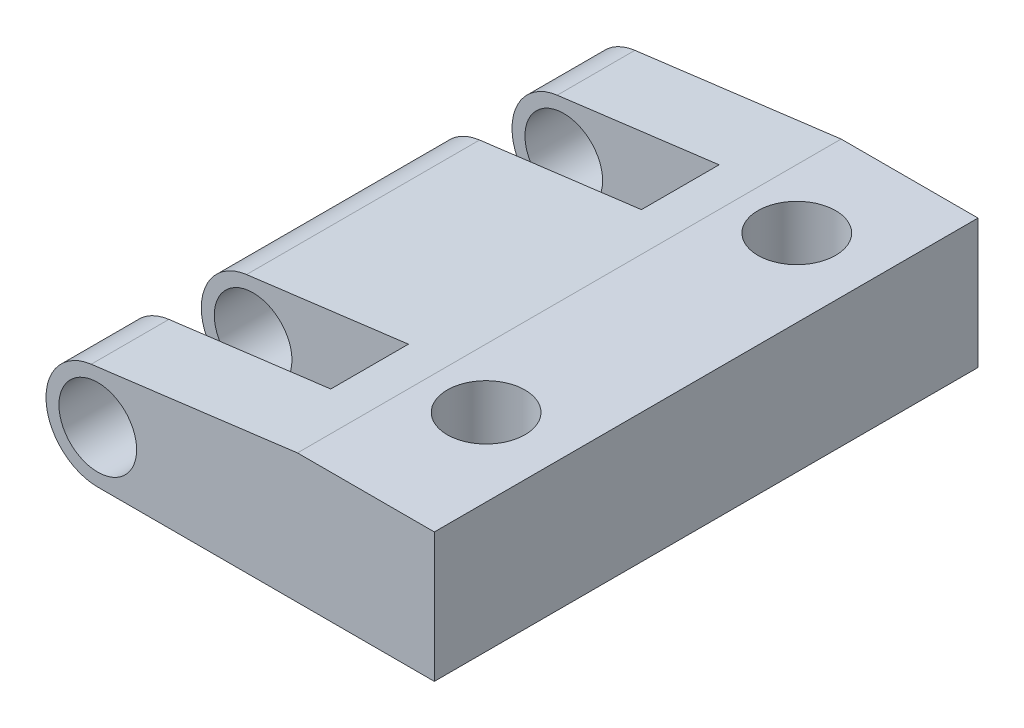
ISO-10303-21;
HEADER;
FILE_DESCRIPTION(('STEP AP214'),'2;1');
FILE_NAME('part.step','',(''),(''),'','','');
FILE_SCHEMA(('AUTOMOTIVE_DESIGN { 1 0 10303 214 1 1 1 1 }'));
ENDSEC;
DATA;
#1=APPLICATION_CONTEXT('core data for automotive mechanical design processes');
#2=APPLICATION_PROTOCOL_DEFINITION('international standard','automotive_design',2000,#1);
#3=PRODUCT_CONTEXT('',#1,'mechanical');
#4=PRODUCT('Part','Part','',(#3));
#5=PRODUCT_RELATED_PRODUCT_CATEGORY('part','',(#4));
#6=PRODUCT_DEFINITION_FORMATION('','',#4);
#7=PRODUCT_DEFINITION_CONTEXT('part definition',#1,'design');
#8=PRODUCT_DEFINITION('design','',#6,#7);
#9=PRODUCT_DEFINITION_SHAPE('','',#8);
#10=(LENGTH_UNIT() NAMED_UNIT(*) SI_UNIT(.MILLI.,.METRE.));
#11=(NAMED_UNIT(*) PLANE_ANGLE_UNIT() SI_UNIT($,.RADIAN.));
#12=(NAMED_UNIT(*) SI_UNIT($,.STERADIAN.) SOLID_ANGLE_UNIT());
#13=UNCERTAINTY_MEASURE_WITH_UNIT(LENGTH_MEASURE(1.E-05),#10,'distance_accuracy_value','');
#14=(GEOMETRIC_REPRESENTATION_CONTEXT(3) GLOBAL_UNCERTAINTY_ASSIGNED_CONTEXT((#13)) GLOBAL_UNIT_ASSIGNED_CONTEXT((#10,
#11,#12)) REPRESENTATION_CONTEXT('',''));
#15=CARTESIAN_POINT('',(0.,0.,0.));
#16=DIRECTION('',(0.,0.,1.));
#17=DIRECTION('',(1.,0.,0.));
#18=AXIS2_PLACEMENT_3D('',#15,#16,#17);
#19=CARTESIAN_POINT('',(-1.93619011185518,5.,21.));
#20=DIRECTION('',(0.126515745811455,-0.99196459919786,0.));
#21=DIRECTION('',(0.99196459919786,0.126515745811455,0.));
#22=AXIS2_PLACEMENT_3D('',#19,#20,#21);
#23=PLANE('',#22);
#24=DIRECTION('',(-0.99196459919786,-0.126515745811455,0.));
#25=VECTOR('',#24,1.);
#26=CARTESIAN_POINT('',(-1.93619011185518,5.,3.));
#27=LINE('',#26,#25);
#28=CARTESIAN_POINT('',(-3.64980545146626,4.78144449620464,3.));
#29=VERTEX_POINT('',#28);
#30=CARTESIAN_POINT('',(-9.90283694308917,3.98392919839572,3.));
#31=VERTEX_POINT('',#30);
#32=EDGE_CURVE('E189',#29,#31,#27,.T.);
#33=ORIENTED_EDGE('',*,*,#32,.F.);
#34=DIRECTION('',(0.,0.,-1.));
#35=VECTOR('',#34,1.);
#36=CARTESIAN_POINT('',(-3.64980545146626,4.78144449620464,21.));
#37=LINE('',#36,#35);
#38=CARTESIAN_POINT('',(-3.64980545146626,4.78144449620464,6.));
#39=VERTEX_POINT('',#38);
#40=EDGE_CURVE('E137',#39,#29,#37,.T.);
#41=ORIENTED_EDGE('',*,*,#40,.F.);
#42=DIRECTION('',(0.99196459919786,0.126515745811455,0.));
#43=VECTOR('',#42,1.);
#44=CARTESIAN_POINT('',(-1.93619011185518,5.,6.));
#45=LINE('',#44,#43);
#46=CARTESIAN_POINT('',(-9.90283694308917,3.98392919839572,6.));
#47=VERTEX_POINT('',#46);
#48=EDGE_CURVE('E186',#47,#39,#45,.T.);
#49=ORIENTED_EDGE('',*,*,#48,.F.);
#50=DIRECTION('',(0.,0.,-1.));
#51=VECTOR('',#50,1.);
#52=CARTESIAN_POINT('',(-9.90283694308917,3.98392919839572,21.));
#53=LINE('',#52,#51);
#54=CARTESIAN_POINT('',(-9.90283694308917,3.98392919839572,15.));
#55=VERTEX_POINT('',#54);
#56=EDGE_CURVE('E44',#55,#47,#53,.T.);
#57=ORIENTED_EDGE('',*,*,#56,.F.);
#58=DIRECTION('',(-0.99196459919786,-0.126515745811455,0.));
#59=VECTOR('',#58,1.);
#60=CARTESIAN_POINT('',(-1.93619011185518,5.,15.));
#61=LINE('',#60,#59);
#62=CARTESIAN_POINT('',(-3.64980545146626,4.78144449620464,15.));
#63=VERTEX_POINT('',#62);
#64=EDGE_CURVE('E181',#63,#55,#61,.T.);
#65=ORIENTED_EDGE('',*,*,#64,.F.);
#66=DIRECTION('',(0.,0.,-1.));
#67=VECTOR('',#66,1.);
#68=CARTESIAN_POINT('',(-3.64980545146626,4.78144449620464,21.));
#69=LINE('',#68,#67);
#70=CARTESIAN_POINT('',(-3.64980545146626,4.78144449620464,18.));
#71=VERTEX_POINT('',#70);
#72=EDGE_CURVE('E191',#71,#63,#69,.T.);
#73=ORIENTED_EDGE('',*,*,#72,.F.);
#74=DIRECTION('',(0.99196459919786,0.126515745811455,0.));
#75=VECTOR('',#74,1.);
#76=CARTESIAN_POINT('',(-1.93619011185518,5.,18.));
#77=LINE('',#76,#75);
#78=CARTESIAN_POINT('',(-9.90283694308917,3.98392919839572,18.));
#79=VERTEX_POINT('',#78);
#80=EDGE_CURVE('E176',#79,#71,#77,.T.);
#81=ORIENTED_EDGE('',*,*,#80,.F.);
#82=CARTESIAN_POINT('',(-9.90283694308917,3.98392919839572,21.));
#83=VERTEX_POINT('',#82);
#84=EDGE_CURVE('E11',#83,#79,#53,.T.);
#85=ORIENTED_EDGE('',*,*,#84,.F.);
#86=DIRECTION('',(-0.99196459919786,-0.126515745811455,0.));
#87=VECTOR('',#86,1.);
#88=CARTESIAN_POINT('',(-1.93619011185518,5.,21.));
#89=LINE('',#88,#87);
#90=CARTESIAN_POINT('',(-1.93619011185518,5.,21.));
#91=VERTEX_POINT('',#90);
#92=EDGE_CURVE('E201',#91,#83,#89,.T.);
#93=ORIENTED_EDGE('',*,*,#92,.F.);
#94=DIRECTION('',(0.,0.,-1.));
#95=VECTOR('',#94,1.);
#96=CARTESIAN_POINT('',(-1.93619011185518,5.,21.));
#97=LINE('',#96,#95);
#98=CARTESIAN_POINT('',(-1.93619011185518,5.,0.));
#99=VERTEX_POINT('',#98);
#100=EDGE_CURVE('E213',#91,#99,#97,.T.);
#101=ORIENTED_EDGE('',*,*,#100,.T.);
#102=DIRECTION('',(-0.99196459919786,-0.126515745811455,0.));
#103=VECTOR('',#102,1.);
#104=CARTESIAN_POINT('',(-1.93619011185518,5.,0.));
#105=LINE('',#104,#103);
#106=CARTESIAN_POINT('',(-9.90283694308917,3.98392919839572,0.));
#107=VERTEX_POINT('',#106);
#108=EDGE_CURVE('E198',#99,#107,#105,.T.);
#109=ORIENTED_EDGE('',*,*,#108,.T.);
#110=EDGE_CURVE('E46',#31,#107,#53,.T.);
#111=ORIENTED_EDGE('',*,*,#110,.F.);
#112=EDGE_LOOP('',(#33,#41,#49,#57,#65,#73,#81,#85,#93,#101,#109,#111));
#113=FACE_BOUND('',#112,.T.);
#114=ADVANCED_FACE('F36',(#113),#23,.F.);
#115=CARTESIAN_POINT('',(-9.64980545146626,2.,21.));
#116=DIRECTION('',(0.,0.,-1.));
#117=DIRECTION('',(-1.,0.,0.));
#118=AXIS2_PLACEMENT_3D('',#115,#116,#117);
#119=CYLINDRICAL_SURFACE('',#118,2.);
#120=DIRECTION('',(0.,0.,-1.));
#121=VECTOR('',#120,1.);
#122=CARTESIAN_POINT('',(-9.64980545146626,0.,21.));
#123=LINE('',#122,#121);
#124=CARTESIAN_POINT('',(-9.64980545146626,0.,3.));
#125=VERTEX_POINT('',#124);
#126=CARTESIAN_POINT('',(-9.64980545146626,0.,0.));
#127=VERTEX_POINT('',#126);
#128=EDGE_CURVE('E232',#125,#127,#123,.T.);
#129=ORIENTED_EDGE('',*,*,#128,.F.);
#130=CARTESIAN_POINT('',(-9.64980545146626,2.,3.));
#131=DIRECTION('',(0.,0.,1.));
#132=DIRECTION('',(1.,0.,0.));
#133=AXIS2_PLACEMENT_3D('',#130,#131,#132);
#134=CIRCLE('',#133,2.);
#135=EDGE_CURVE('E147',#31,#125,#134,.T.);
#136=ORIENTED_EDGE('',*,*,#135,.F.);
#137=ORIENTED_EDGE('',*,*,#110,.T.);
#138=CARTESIAN_POINT('',(-9.64980545146626,2.,0.));
#139=DIRECTION('',(0.,0.,1.));
#140=DIRECTION('',(1.,0.,0.));
#141=AXIS2_PLACEMENT_3D('',#138,#139,#140);
#142=CIRCLE('',#141,2.);
#143=EDGE_CURVE('E216',#107,#127,#142,.T.);
#144=ORIENTED_EDGE('',*,*,#143,.T.);
#145=EDGE_LOOP('',(#129,#136,#137,#144));
#146=FACE_BOUND('',#145,.T.);
#147=ADVANCED_FACE('F256',(#146),#119,.T.);
#148=CARTESIAN_POINT('',(-9.64980545146626,2.,6.));
#149=DIRECTION('',(0.,0.,-1.));
#150=DIRECTION('',(-1.,0.,0.));
#151=AXIS2_PLACEMENT_3D('',#148,#149,#150);
#152=CIRCLE('',#151,2.);
#153=CARTESIAN_POINT('',(-9.64980545146626,0.,6.));
#154=VERTEX_POINT('',#153);
#155=EDGE_CURVE('E184',#154,#47,#152,.T.);
#156=ORIENTED_EDGE('',*,*,#155,.F.);
#157=CARTESIAN_POINT('',(-9.64980545146626,0.,15.));
#158=VERTEX_POINT('',#157);
#159=EDGE_CURVE('E235',#158,#154,#123,.T.);
#160=ORIENTED_EDGE('',*,*,#159,.F.);
#161=CARTESIAN_POINT('',(-9.64980545146626,2.,15.));
#162=DIRECTION('',(0.,0.,1.));
#163=DIRECTION('',(1.,0.,0.));
#164=AXIS2_PLACEMENT_3D('',#161,#162,#163);
#165=CIRCLE('',#164,2.);
#166=EDGE_CURVE('E179',#55,#158,#165,.T.);
#167=ORIENTED_EDGE('',*,*,#166,.F.);
#168=ORIENTED_EDGE('',*,*,#56,.T.);
#169=EDGE_LOOP('',(#156,#160,#167,#168));
#170=FACE_BOUND('',#169,.T.);
#171=ADVANCED_FACE('F263',(#170),#119,.T.);
#172=CARTESIAN_POINT('',(-9.64980545146626,2.,18.));
#173=DIRECTION('',(0.,0.,-1.));
#174=DIRECTION('',(-1.,0.,0.));
#175=AXIS2_PLACEMENT_3D('',#172,#173,#174);
#176=CIRCLE('',#175,2.);
#177=CARTESIAN_POINT('',(-9.64980545146626,0.,18.));
#178=VERTEX_POINT('',#177);
#179=EDGE_CURVE('E174',#178,#79,#176,.T.);
#180=ORIENTED_EDGE('',*,*,#179,.F.);
#181=CARTESIAN_POINT('',(-9.64980545146626,0.,21.));
#182=VERTEX_POINT('',#181);
#183=EDGE_CURVE('E233',#182,#178,#123,.T.);
#184=ORIENTED_EDGE('',*,*,#183,.F.);
#185=CARTESIAN_POINT('',(-9.64980545146626,2.,21.));
#186=DIRECTION('',(0.,0.,1.));
#187=DIRECTION('',(1.,0.,0.));
#188=AXIS2_PLACEMENT_3D('',#185,#186,#187);
#189=CIRCLE('',#188,2.);
#190=EDGE_CURVE('E204',#83,#182,#189,.T.);
#191=ORIENTED_EDGE('',*,*,#190,.F.);
#192=ORIENTED_EDGE('',*,*,#84,.T.);
#193=EDGE_LOOP('',(#180,#184,#191,#192));
#194=FACE_BOUND('',#193,.T.);
#195=ADVANCED_FACE('F278',(#194),#119,.T.);
#196=CARTESIAN_POINT('',(3.35019454853374,0.,21.));
#197=DIRECTION('',(0.,1.,0.));
#198=DIRECTION('',(0.,0.,1.));
#199=AXIS2_PLACEMENT_3D('',#196,#197,#198);
#200=PLANE('',#199);
#201=CARTESIAN_POINT('',(0.350194548533737,0.,4.));
#202=DIRECTION('',(0.,1.,0.));
#203=DIRECTION('',(0.,0.,1.));
#204=AXIS2_PLACEMENT_3D('',#201,#202,#203);
#205=CIRCLE('',#204,1.5);
#206=CARTESIAN_POINT('',(0.350194548533737,0.,5.5));
#207=VERTEX_POINT('',#206);
#208=EDGE_CURVE('E161',#207,#207,#205,.T.);
#209=ORIENTED_EDGE('',*,*,#208,.T.);
#210=EDGE_LOOP('',(#209));
#211=FACE_BOUND('',#210,.T.);
#212=CARTESIAN_POINT('',(0.350194548533737,0.,16.));
#213=DIRECTION('',(0.,1.,0.));
#214=DIRECTION('',(0.,0.,1.));
#215=AXIS2_PLACEMENT_3D('',#212,#213,#214);
#216=CIRCLE('',#215,1.5);
#217=CARTESIAN_POINT('',(0.350194548533737,0.,17.5));
#218=VERTEX_POINT('',#217);
#219=EDGE_CURVE('E332',#218,#218,#216,.T.);
#220=ORIENTED_EDGE('',*,*,#219,.T.);
#221=EDGE_LOOP('',(#220));
#222=FACE_BOUND('',#221,.T.);
#223=DIRECTION('',(-1.,0.,0.));
#224=VECTOR('',#223,1.);
#225=CARTESIAN_POINT('',(-3.64980545146626,0.,3.));
#226=LINE('',#225,#224);
#227=CARTESIAN_POINT('',(-3.64980545146626,0.,3.));
#228=VERTEX_POINT('',#227);
#229=EDGE_CURVE('E144',#228,#125,#226,.T.);
#230=ORIENTED_EDGE('',*,*,#229,.T.);
#231=ORIENTED_EDGE('',*,*,#128,.T.);
#232=DIRECTION('',(1.,0.,0.));
#233=VECTOR('',#232,1.);
#234=CARTESIAN_POINT('',(3.35019454853374,0.,0.));
#235=LINE('',#234,#233);
#236=CARTESIAN_POINT('',(3.35019454853374,0.,0.));
#237=VERTEX_POINT('',#236);
#238=EDGE_CURVE('E219',#127,#237,#235,.T.);
#239=ORIENTED_EDGE('',*,*,#238,.T.);
#240=DIRECTION('',(0.,0.,-1.));
#241=VECTOR('',#240,1.);
#242=CARTESIAN_POINT('',(3.35019454853374,0.,21.));
#243=LINE('',#242,#241);
#244=CARTESIAN_POINT('',(3.35019454853374,0.,21.));
#245=VERTEX_POINT('',#244);
#246=EDGE_CURVE('E229',#245,#237,#243,.T.);
#247=ORIENTED_EDGE('',*,*,#246,.F.);
#248=DIRECTION('',(1.,0.,0.));
#249=VECTOR('',#248,1.);
#250=CARTESIAN_POINT('',(0.,0.,21.));
#251=LINE('',#250,#249);
#252=EDGE_CURVE('E207',#182,#245,#251,.T.);
#253=ORIENTED_EDGE('',*,*,#252,.F.);
#254=ORIENTED_EDGE('',*,*,#183,.T.);
#255=DIRECTION('',(1.,0.,0.));
#256=VECTOR('',#255,1.);
#257=CARTESIAN_POINT('',(-3.64980545146626,0.,18.));
#258=LINE('',#257,#256);
#259=CARTESIAN_POINT('',(-3.64980545146626,0.,18.));
#260=VERTEX_POINT('',#259);
#261=EDGE_CURVE('E170',#178,#260,#258,.T.);
#262=ORIENTED_EDGE('',*,*,#261,.T.);
#263=DIRECTION('',(0.,0.,-1.));
#264=VECTOR('',#263,1.);
#265=CARTESIAN_POINT('',(-3.64980545146626,0.,15.));
#266=LINE('',#265,#264);
#267=CARTESIAN_POINT('',(-3.64980545146626,0.,15.));
#268=VERTEX_POINT('',#267);
#269=EDGE_CURVE('E61',#260,#268,#266,.T.);
#270=ORIENTED_EDGE('',*,*,#269,.T.);
#271=DIRECTION('',(-1.,0.,0.));
#272=VECTOR('',#271,1.);
#273=CARTESIAN_POINT('',(-3.64980545146626,0.,15.));
#274=LINE('',#273,#272);
#275=EDGE_CURVE('E167',#268,#158,#274,.T.);
#276=ORIENTED_EDGE('',*,*,#275,.T.);
#277=ORIENTED_EDGE('',*,*,#159,.T.);
#278=DIRECTION('',(1.,0.,0.));
#279=VECTOR('',#278,1.);
#280=CARTESIAN_POINT('',(-3.64980545146626,0.,6.));
#281=LINE('',#280,#279);
#282=CARTESIAN_POINT('',(-3.64980545146626,0.,6.));
#283=VERTEX_POINT('',#282);
#284=EDGE_CURVE('E150',#154,#283,#281,.T.);
#285=ORIENTED_EDGE('',*,*,#284,.T.);
#286=DIRECTION('',(0.,0.,-1.));
#287=VECTOR('',#286,1.);
#288=CARTESIAN_POINT('',(-3.64980545146626,0.,3.));
#289=LINE('',#288,#287);
#290=EDGE_CURVE('E53',#283,#228,#289,.T.);
#291=ORIENTED_EDGE('',*,*,#290,.T.);
#292=EDGE_LOOP('',(#230,#231,#239,#247,#253,#254,#262,#270,#276,#277,#285,#291));
#293=FACE_BOUND('',#292,.T.);
#294=ADVANCED_FACE('F153',(#211,#222,#293),#200,.F.);
#295=CARTESIAN_POINT('',(-9.64980545146626,2.,21.));
#296=DIRECTION('',(0.,0.,-1.));
#297=DIRECTION('',(-1.,0.,0.));
#298=AXIS2_PLACEMENT_3D('',#295,#296,#297);
#299=CYLINDRICAL_SURFACE('',#298,1.5);
#300=CARTESIAN_POINT('',(-9.64980545146626,2.,0.));
#301=DIRECTION('',(0.,0.,1.));
#302=DIRECTION('',(1.,0.,0.));
#303=AXIS2_PLACEMENT_3D('',#300,#301,#302);
#304=CIRCLE('',#303,1.5);
#305=CARTESIAN_POINT('',(-8.14980545146626,2.,0.));
#306=VERTEX_POINT('',#305);
#307=EDGE_CURVE('E194',#306,#306,#304,.T.);
#308=ORIENTED_EDGE('',*,*,#307,.F.);
#309=EDGE_LOOP('',(#308));
#310=FACE_BOUND('',#309,.T.);
#311=CARTESIAN_POINT('',(-9.64980545146626,2.,3.));
#312=DIRECTION('',(0.,0.,1.));
#313=DIRECTION('',(1.,0.,0.));
#314=AXIS2_PLACEMENT_3D('',#311,#312,#313);
#315=CIRCLE('',#314,1.5);
#316=CARTESIAN_POINT('',(-8.14980545146626,2.,3.));
#317=VERTEX_POINT('',#316);
#318=EDGE_CURVE('E39',#317,#317,#315,.T.);
#319=ORIENTED_EDGE('',*,*,#318,.T.);
#320=EDGE_LOOP('',(#319));
#321=FACE_BOUND('',#320,.T.);
#322=ADVANCED_FACE('F319',(#310,#321),#299,.F.);
#323=CARTESIAN_POINT('',(-9.64980545146626,2.,21.));
#324=DIRECTION('',(0.,0.,1.));
#325=DIRECTION('',(1.,0.,0.));
#326=AXIS2_PLACEMENT_3D('',#323,#324,#325);
#327=CIRCLE('',#326,1.5);
#328=CARTESIAN_POINT('',(-8.14980545146626,2.,21.));
#329=VERTEX_POINT('',#328);
#330=EDGE_CURVE('E195',#329,#329,#327,.T.);
#331=ORIENTED_EDGE('',*,*,#330,.T.);
#332=EDGE_LOOP('',(#331));
#333=FACE_BOUND('',#332,.T.);
#334=CARTESIAN_POINT('',(-9.64980545146626,2.,18.));
#335=DIRECTION('',(0.,0.,-1.));
#336=DIRECTION('',(-1.,0.,0.));
#337=AXIS2_PLACEMENT_3D('',#334,#335,#336);
#338=CIRCLE('',#337,1.5);
#339=CARTESIAN_POINT('',(-11.1498054514663,2.,18.));
#340=VERTEX_POINT('',#339);
#341=EDGE_CURVE('E140',#340,#340,#338,.T.);
#342=ORIENTED_EDGE('',*,*,#341,.T.);
#343=EDGE_LOOP('',(#342));
#344=FACE_BOUND('',#343,.T.);
#345=ADVANCED_FACE('F324',(#333,#344),#299,.F.);
#346=CARTESIAN_POINT('',(-9.64980545146626,2.,21.));
#347=DIRECTION('',(0.,0.,1.));
#348=DIRECTION('',(1.,0.,0.));
#349=AXIS2_PLACEMENT_3D('',#346,#347,#348);
#350=PLANE('',#349);
#351=ORIENTED_EDGE('',*,*,#92,.T.);
#352=ORIENTED_EDGE('',*,*,#190,.T.);
#353=ORIENTED_EDGE('',*,*,#252,.T.);
#354=DIRECTION('',(0.,1.,0.));
#355=VECTOR('',#354,1.);
#356=CARTESIAN_POINT('',(3.35019454853374,5.,21.));
#357=LINE('',#356,#355);
#358=CARTESIAN_POINT('',(3.35019454853374,5.,21.));
#359=VERTEX_POINT('',#358);
#360=EDGE_CURVE('E209',#245,#359,#357,.T.);
#361=ORIENTED_EDGE('',*,*,#360,.T.);
#362=DIRECTION('',(-1.,0.,0.));
#363=VECTOR('',#362,1.);
#364=CARTESIAN_POINT('',(-1.93619011185518,5.,21.));
#365=LINE('',#364,#363);
#366=EDGE_CURVE('E211',#359,#91,#365,.T.);
#367=ORIENTED_EDGE('',*,*,#366,.T.);
#368=EDGE_LOOP('',(#351,#352,#353,#361,#367));
#369=FACE_BOUND('',#368,.T.);
#370=ORIENTED_EDGE('',*,*,#330,.F.);
#371=EDGE_LOOP('',(#370));
#372=FACE_BOUND('',#371,.T.);
#373=ADVANCED_FACE('F284',(#369,#372),#350,.T.);
#374=CARTESIAN_POINT('',(-9.64980545146626,2.,0.));
#375=DIRECTION('',(0.,0.,1.));
#376=DIRECTION('',(1.,0.,0.));
#377=AXIS2_PLACEMENT_3D('',#374,#375,#376);
#378=PLANE('',#377);
#379=ORIENTED_EDGE('',*,*,#108,.F.);
#380=DIRECTION('',(-1.,0.,0.));
#381=VECTOR('',#380,1.);
#382=CARTESIAN_POINT('',(-1.93619011185518,5.,0.));
#383=LINE('',#382,#381);
#384=CARTESIAN_POINT('',(3.35019454853374,5.,0.));
#385=VERTEX_POINT('',#384);
#386=EDGE_CURVE('E205',#385,#99,#383,.T.);
#387=ORIENTED_EDGE('',*,*,#386,.F.);
#388=DIRECTION('',(0.,1.,0.));
#389=VECTOR('',#388,1.);
#390=CARTESIAN_POINT('',(3.35019454853374,5.,0.));
#391=LINE('',#390,#389);
#392=EDGE_CURVE('E221',#237,#385,#391,.T.);
#393=ORIENTED_EDGE('',*,*,#392,.F.);
#394=ORIENTED_EDGE('',*,*,#238,.F.);
#395=ORIENTED_EDGE('',*,*,#143,.F.);
#396=EDGE_LOOP('',(#379,#387,#393,#394,#395));
#397=FACE_BOUND('',#396,.T.);
#398=ORIENTED_EDGE('',*,*,#307,.T.);
#399=EDGE_LOOP('',(#398));
#400=FACE_BOUND('',#399,.T.);
#401=ADVANCED_FACE('F294',(#397,#400),#378,.F.);
#402=CARTESIAN_POINT('',(3.35019454853374,5.,21.));
#403=DIRECTION('',(-1.,0.,0.));
#404=DIRECTION('',(0.,-1.,0.));
#405=AXIS2_PLACEMENT_3D('',#402,#403,#404);
#406=PLANE('',#405);
#407=ORIENTED_EDGE('',*,*,#392,.T.);
#408=DIRECTION('',(0.,0.,-1.));
#409=VECTOR('',#408,1.);
#410=CARTESIAN_POINT('',(3.35019454853374,5.,21.));
#411=LINE('',#410,#409);
#412=EDGE_CURVE('E226',#359,#385,#411,.T.);
#413=ORIENTED_EDGE('',*,*,#412,.F.);
#414=ORIENTED_EDGE('',*,*,#360,.F.);
#415=ORIENTED_EDGE('',*,*,#246,.T.);
#416=EDGE_LOOP('',(#407,#413,#414,#415));
#417=FACE_BOUND('',#416,.T.);
#418=ADVANCED_FACE('F297',(#417),#406,.F.);
#419=CARTESIAN_POINT('',(-1.93619011185518,5.,21.));
#420=DIRECTION('',(0.,-1.,0.));
#421=DIRECTION('',(0.,0.,-1.));
#422=AXIS2_PLACEMENT_3D('',#419,#420,#421);
#423=PLANE('',#422);
#424=CARTESIAN_POINT('',(0.350194548533737,5.,4.));
#425=DIRECTION('',(0.,1.,0.));
#426=DIRECTION('',(0.,0.,1.));
#427=AXIS2_PLACEMENT_3D('',#424,#425,#426);
#428=CIRCLE('',#427,1.5);
#429=CARTESIAN_POINT('',(0.350194548533737,5.,5.5));
#430=VERTEX_POINT('',#429);
#431=EDGE_CURVE('E334',#430,#430,#428,.T.);
#432=ORIENTED_EDGE('',*,*,#431,.F.);
#433=EDGE_LOOP('',(#432));
#434=FACE_BOUND('',#433,.T.);
#435=CARTESIAN_POINT('',(0.350194548533737,5.,16.));
#436=DIRECTION('',(0.,1.,0.));
#437=DIRECTION('',(0.,0.,1.));
#438=AXIS2_PLACEMENT_3D('',#435,#436,#437);
#439=CIRCLE('',#438,1.5);
#440=CARTESIAN_POINT('',(0.350194548533737,5.,17.5));
#441=VERTEX_POINT('',#440);
#442=EDGE_CURVE('E336',#441,#441,#439,.T.);
#443=ORIENTED_EDGE('',*,*,#442,.F.);
#444=EDGE_LOOP('',(#443));
#445=FACE_BOUND('',#444,.T.);
#446=ORIENTED_EDGE('',*,*,#386,.T.);
#447=ORIENTED_EDGE('',*,*,#100,.F.);
#448=ORIENTED_EDGE('',*,*,#366,.F.);
#449=ORIENTED_EDGE('',*,*,#412,.T.);
#450=EDGE_LOOP('',(#446,#447,#448,#449));
#451=FACE_BOUND('',#450,.T.);
#452=ADVANCED_FACE('F290',(#434,#445,#451),#423,.F.);
#453=CARTESIAN_POINT('',(-3.64980545146626,5.,15.));
#454=DIRECTION('',(-1.,0.,0.));
#455=DIRECTION('',(0.,0.,1.));
#456=AXIS2_PLACEMENT_3D('',#453,#454,#455);
#457=PLANE('',#456);
#458=ORIENTED_EDGE('',*,*,#72,.T.);
#459=DIRECTION('',(0.,-1.,0.));
#460=VECTOR('',#459,1.);
#461=CARTESIAN_POINT('',(-3.64980545146626,5.,15.));
#462=LINE('',#461,#460);
#463=EDGE_CURVE('E156',#63,#268,#462,.T.);
#464=ORIENTED_EDGE('',*,*,#463,.T.);
#465=ORIENTED_EDGE('',*,*,#269,.F.);
#466=DIRECTION('',(0.,-1.,0.));
#467=VECTOR('',#466,1.);
#468=CARTESIAN_POINT('',(-3.64980545146626,5.,18.));
#469=LINE('',#468,#467);
#470=EDGE_CURVE('E158',#71,#260,#469,.T.);
#471=ORIENTED_EDGE('',*,*,#470,.F.);
#472=EDGE_LOOP('',(#458,#464,#465,#471));
#473=FACE_BOUND('',#472,.T.);
#474=ADVANCED_FACE('F270',(#473),#457,.T.);
#475=CARTESIAN_POINT('',(-3.64980545146626,5.,15.));
#476=DIRECTION('',(0.,0.,1.));
#477=DIRECTION('',(1.,0.,0.));
#478=AXIS2_PLACEMENT_3D('',#475,#476,#477);
#479=PLANE('',#478);
#480=CARTESIAN_POINT('',(-9.64980545146626,2.,15.));
#481=DIRECTION('',(0.,0.,1.));
#482=DIRECTION('',(1.,0.,0.));
#483=AXIS2_PLACEMENT_3D('',#480,#481,#482);
#484=CIRCLE('',#483,1.5);
#485=CARTESIAN_POINT('',(-8.14980545146626,2.,15.));
#486=VERTEX_POINT('',#485);
#487=EDGE_CURVE('E178',#486,#486,#484,.T.);
#488=ORIENTED_EDGE('',*,*,#487,.F.);
#489=EDGE_LOOP('',(#488));
#490=FACE_BOUND('',#489,.T.);
#491=ORIENTED_EDGE('',*,*,#64,.T.);
#492=ORIENTED_EDGE('',*,*,#166,.T.);
#493=ORIENTED_EDGE('',*,*,#275,.F.);
#494=ORIENTED_EDGE('',*,*,#463,.F.);
#495=EDGE_LOOP('',(#491,#492,#493,#494));
#496=FACE_BOUND('',#495,.T.);
#497=ADVANCED_FACE('F269',(#490,#496),#479,.T.);
#498=CARTESIAN_POINT('',(-3.64980545146626,5.,18.));
#499=DIRECTION('',(0.,0.,-1.));
#500=DIRECTION('',(-1.,0.,0.));
#501=AXIS2_PLACEMENT_3D('',#498,#499,#500);
#502=PLANE('',#501);
#503=ORIENTED_EDGE('',*,*,#341,.F.);
#504=EDGE_LOOP('',(#503));
#505=FACE_BOUND('',#504,.T.);
#506=ORIENTED_EDGE('',*,*,#80,.T.);
#507=ORIENTED_EDGE('',*,*,#470,.T.);
#508=ORIENTED_EDGE('',*,*,#261,.F.);
#509=ORIENTED_EDGE('',*,*,#179,.T.);
#510=EDGE_LOOP('',(#506,#507,#508,#509));
#511=FACE_BOUND('',#510,.T.);
#512=ADVANCED_FACE('F273',(#505,#511),#502,.T.);
#513=ORIENTED_EDGE('',*,*,#487,.T.);
#514=EDGE_LOOP('',(#513));
#515=FACE_BOUND('',#514,.T.);
#516=CARTESIAN_POINT('',(-9.64980545146626,2.,6.));
#517=DIRECTION('',(0.,0.,-1.));
#518=DIRECTION('',(-1.,0.,0.));
#519=AXIS2_PLACEMENT_3D('',#516,#517,#518);
#520=CIRCLE('',#519,1.5);
#521=CARTESIAN_POINT('',(-11.1498054514663,2.,6.));
#522=VERTEX_POINT('',#521);
#523=EDGE_CURVE('E183',#522,#522,#520,.T.);
#524=ORIENTED_EDGE('',*,*,#523,.T.);
#525=EDGE_LOOP('',(#524));
#526=FACE_BOUND('',#525,.T.);
#527=ADVANCED_FACE('F243',(#515,#526),#299,.F.);
#528=CARTESIAN_POINT('',(-3.64980545146626,5.,3.));
#529=DIRECTION('',(-1.,0.,0.));
#530=DIRECTION('',(0.,0.,1.));
#531=AXIS2_PLACEMENT_3D('',#528,#529,#530);
#532=PLANE('',#531);
#533=ORIENTED_EDGE('',*,*,#40,.T.);
#534=DIRECTION('',(0.,-1.,0.));
#535=VECTOR('',#534,1.);
#536=CARTESIAN_POINT('',(-3.64980545146626,5.,3.));
#537=LINE('',#536,#535);
#538=EDGE_CURVE('E133',#29,#228,#537,.T.);
#539=ORIENTED_EDGE('',*,*,#538,.T.);
#540=ORIENTED_EDGE('',*,*,#290,.F.);
#541=DIRECTION('',(0.,-1.,0.));
#542=VECTOR('',#541,1.);
#543=CARTESIAN_POINT('',(-3.64980545146626,5.,6.));
#544=LINE('',#543,#542);
#545=EDGE_CURVE('E141',#39,#283,#544,.T.);
#546=ORIENTED_EDGE('',*,*,#545,.F.);
#547=EDGE_LOOP('',(#533,#539,#540,#546));
#548=FACE_BOUND('',#547,.T.);
#549=ADVANCED_FACE('F135',(#548),#532,.T.);
#550=CARTESIAN_POINT('',(-3.64980545146626,5.,3.));
#551=DIRECTION('',(0.,0.,1.));
#552=DIRECTION('',(1.,0.,0.));
#553=AXIS2_PLACEMENT_3D('',#550,#551,#552);
#554=PLANE('',#553);
#555=ORIENTED_EDGE('',*,*,#318,.F.);
#556=EDGE_LOOP('',(#555));
#557=FACE_BOUND('',#556,.T.);
#558=ORIENTED_EDGE('',*,*,#32,.T.);
#559=ORIENTED_EDGE('',*,*,#135,.T.);
#560=ORIENTED_EDGE('',*,*,#229,.F.);
#561=ORIENTED_EDGE('',*,*,#538,.F.);
#562=EDGE_LOOP('',(#558,#559,#560,#561));
#563=FACE_BOUND('',#562,.T.);
#564=ADVANCED_FACE('F145',(#557,#563),#554,.T.);
#565=CARTESIAN_POINT('',(-3.64980545146626,5.,6.));
#566=DIRECTION('',(0.,0.,-1.));
#567=DIRECTION('',(-1.,0.,0.));
#568=AXIS2_PLACEMENT_3D('',#565,#566,#567);
#569=PLANE('',#568);
#570=ORIENTED_EDGE('',*,*,#523,.F.);
#571=EDGE_LOOP('',(#570));
#572=FACE_BOUND('',#571,.T.);
#573=ORIENTED_EDGE('',*,*,#48,.T.);
#574=ORIENTED_EDGE('',*,*,#545,.T.);
#575=ORIENTED_EDGE('',*,*,#284,.F.);
#576=ORIENTED_EDGE('',*,*,#155,.T.);
#577=EDGE_LOOP('',(#573,#574,#575,#576));
#578=FACE_BOUND('',#577,.T.);
#579=ADVANCED_FACE('F245',(#572,#578),#569,.T.);
#580=CARTESIAN_POINT('',(0.350194548533737,-16.,16.));
#581=DIRECTION('',(0.,1.,0.));
#582=DIRECTION('',(0.,0.,1.));
#583=AXIS2_PLACEMENT_3D('',#580,#581,#582);
#584=CYLINDRICAL_SURFACE('',#583,1.5);
#585=ORIENTED_EDGE('',*,*,#442,.T.);
#586=EDGE_LOOP('',(#585));
#587=FACE_BOUND('',#586,.T.);
#588=ORIENTED_EDGE('',*,*,#219,.F.);
#589=EDGE_LOOP('',(#588));
#590=FACE_BOUND('',#589,.T.);
#591=ADVANCED_FACE('F248',(#587,#590),#584,.F.);
#592=CARTESIAN_POINT('',(0.350194548533737,-16.,4.));
#593=DIRECTION('',(0.,1.,0.));
#594=DIRECTION('',(0.,0.,1.));
#595=AXIS2_PLACEMENT_3D('',#592,#593,#594);
#596=CYLINDRICAL_SURFACE('',#595,1.5);
#597=ORIENTED_EDGE('',*,*,#431,.T.);
#598=EDGE_LOOP('',(#597));
#599=FACE_BOUND('',#598,.T.);
#600=ORIENTED_EDGE('',*,*,#208,.F.);
#601=EDGE_LOOP('',(#600));
#602=FACE_BOUND('',#601,.T.);
#603=ADVANCED_FACE('F344',(#599,#602),#596,.F.);
#604=CLOSED_SHELL('',(#114,#147,#171,#195,#294,#322,#345,#373,#401,#418,#452,#474,#497,#512,
#527,#549,#564,#579,#591,#603));
#605=MANIFOLD_SOLID_BREP('B2',#604);
#606=ADVANCED_BREP_SHAPE_REPRESENTATION('',(#18,#605),#14);
#607=SHAPE_DEFINITION_REPRESENTATION(#9,#606);
ENDSEC;
END-ISO-10303-21;
